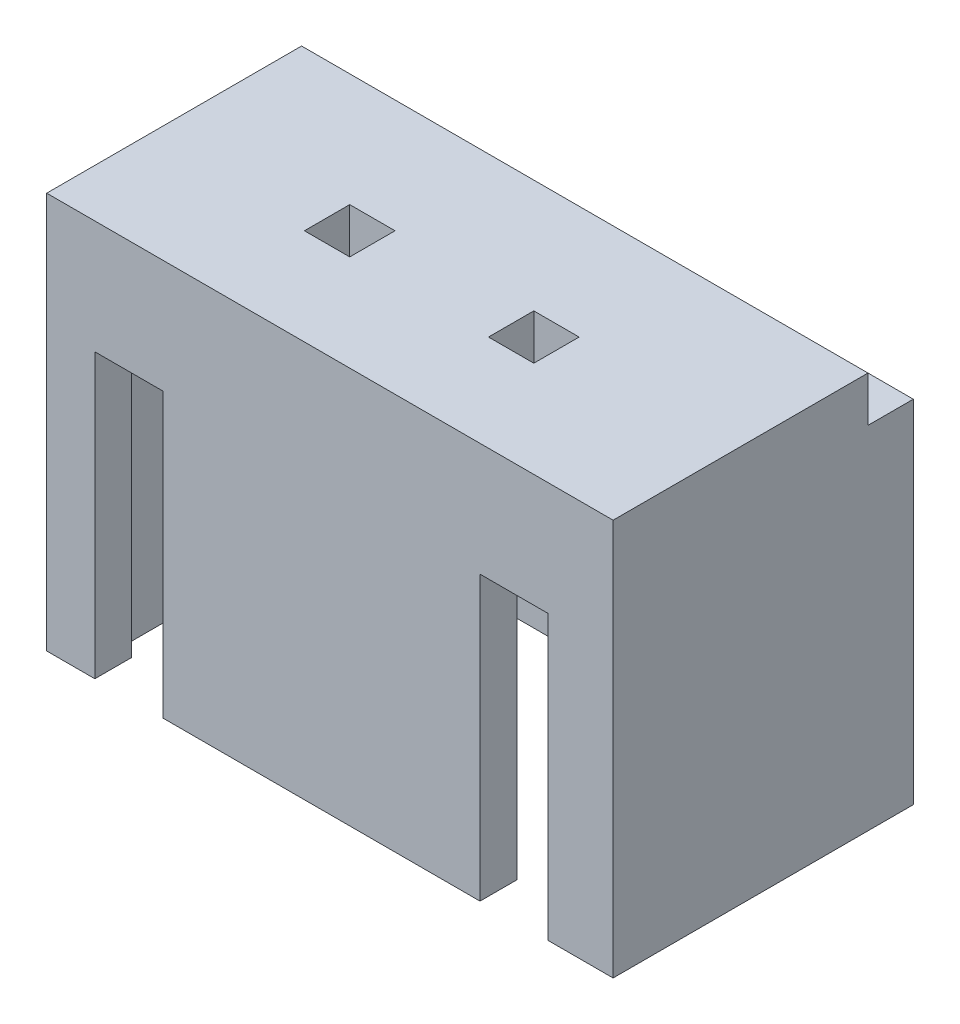
ISO-10303-21;
HEADER;
FILE_DESCRIPTION(('STEP AP214'),'2;1');
FILE_NAME('part.step','',(''),(''),'','','');
FILE_SCHEMA(('AUTOMOTIVE_DESIGN { 1 0 10303 214 1 1 1 1 }'));
ENDSEC;
DATA;
#1=APPLICATION_CONTEXT('core data for automotive mechanical design processes');
#2=APPLICATION_PROTOCOL_DEFINITION('international standard','automotive_design',2000,#1);
#3=PRODUCT_CONTEXT('',#1,'mechanical');
#4=PRODUCT('Part','Part','',(#3));
#5=PRODUCT_RELATED_PRODUCT_CATEGORY('part','',(#4));
#6=PRODUCT_DEFINITION_FORMATION('','',#4);
#7=PRODUCT_DEFINITION_CONTEXT('part definition',#1,'design');
#8=PRODUCT_DEFINITION('design','',#6,#7);
#9=PRODUCT_DEFINITION_SHAPE('','',#8);
#10=(LENGTH_UNIT() NAMED_UNIT(*) SI_UNIT(.MILLI.,.METRE.));
#11=(NAMED_UNIT(*) PLANE_ANGLE_UNIT() SI_UNIT($,.RADIAN.));
#12=(NAMED_UNIT(*) SI_UNIT($,.STERADIAN.) SOLID_ANGLE_UNIT());
#13=UNCERTAINTY_MEASURE_WITH_UNIT(LENGTH_MEASURE(1.E-05),#10,'distance_accuracy_value','');
#14=(GEOMETRIC_REPRESENTATION_CONTEXT(3) GLOBAL_UNCERTAINTY_ASSIGNED_CONTEXT((#13)) GLOBAL_UNIT_ASSIGNED_CONTEXT((#10,
#11,#12)) REPRESENTATION_CONTEXT('',''));
#15=CARTESIAN_POINT('',(0.,0.,0.));
#16=DIRECTION('',(0.,0.,1.));
#17=DIRECTION('',(1.,0.,0.));
#18=AXIS2_PLACEMENT_3D('',#15,#16,#17);
#19=CARTESIAN_POINT('',(5.,7.,2.65));
#20=DIRECTION('',(-1.,0.,0.));
#21=DIRECTION('',(0.,0.,1.));
#22=AXIS2_PLACEMENT_3D('',#19,#20,#21);
#23=PLANE('',#22);
#24=DIRECTION('',(0.,1.,0.));
#25=VECTOR('',#24,1.);
#26=CARTESIAN_POINT('',(5.,6.2,-1.85));
#27=LINE('',#26,#25);
#28=CARTESIAN_POINT('',(5.,6.2,-1.85));
#29=VERTEX_POINT('',#28);
#30=CARTESIAN_POINT('',(5.,7.,-1.85));
#31=VERTEX_POINT('',#30);
#32=EDGE_CURVE('E304',#29,#31,#27,.T.);
#33=ORIENTED_EDGE('',*,*,#32,.T.);
#34=DIRECTION('',(0.,0.,-1.));
#35=VECTOR('',#34,1.);
#36=CARTESIAN_POINT('',(5.,7.,2.65));
#37=LINE('',#36,#35);
#38=CARTESIAN_POINT('',(5.,7.,2.65));
#39=VERTEX_POINT('',#38);
#40=EDGE_CURVE('E380',#39,#31,#37,.T.);
#41=ORIENTED_EDGE('',*,*,#40,.F.);
#42=DIRECTION('',(0.,-1.,0.));
#43=VECTOR('',#42,1.);
#44=CARTESIAN_POINT('',(5.,7.,2.65));
#45=LINE('',#44,#43);
#46=CARTESIAN_POINT('',(5.,0.,2.65));
#47=VERTEX_POINT('',#46);
#48=EDGE_CURVE('E388',#39,#47,#45,.T.);
#49=ORIENTED_EDGE('',*,*,#48,.T.);
#50=DIRECTION('',(0.,0.,-1.));
#51=VECTOR('',#50,1.);
#52=CARTESIAN_POINT('',(5.,0.,2.65));
#53=LINE('',#52,#51);
#54=CARTESIAN_POINT('',(5.,0.,-2.65));
#55=VERTEX_POINT('',#54);
#56=EDGE_CURVE('E375',#47,#55,#53,.T.);
#57=ORIENTED_EDGE('',*,*,#56,.T.);
#58=DIRECTION('',(0.,-1.,0.));
#59=VECTOR('',#58,1.);
#60=CARTESIAN_POINT('',(5.,7.,-2.65));
#61=LINE('',#60,#59);
#62=CARTESIAN_POINT('',(5.,6.2,-2.65));
#63=VERTEX_POINT('',#62);
#64=EDGE_CURVE('E407',#63,#55,#61,.T.);
#65=ORIENTED_EDGE('',*,*,#64,.F.);
#66=DIRECTION('',(0.,0.,-1.));
#67=VECTOR('',#66,1.);
#68=CARTESIAN_POINT('',(5.,6.2,-1.85));
#69=LINE('',#68,#67);
#70=EDGE_CURVE('E292',#29,#63,#69,.T.);
#71=ORIENTED_EDGE('',*,*,#70,.F.);
#72=EDGE_LOOP('',(#33,#41,#49,#57,#65,#71));
#73=FACE_BOUND('',#72,.T.);
#74=ADVANCED_FACE('F33',(#73),#23,.F.);
#75=CARTESIAN_POINT('',(-5.,7.,-2.65));
#76=DIRECTION('',(0.,0.,1.));
#77=DIRECTION('',(1.,0.,0.));
#78=AXIS2_PLACEMENT_3D('',#75,#76,#77);
#79=PLANE('',#78);
#80=DIRECTION('',(-1.,0.,0.));
#81=VECTOR('',#80,1.);
#82=CARTESIAN_POINT('',(5.,6.2,-2.65));
#83=LINE('',#82,#81);
#84=CARTESIAN_POINT('',(-5.,6.2,-2.65));
#85=VERTEX_POINT('',#84);
#86=EDGE_CURVE('E294',#63,#85,#83,.T.);
#87=ORIENTED_EDGE('',*,*,#86,.F.);
#88=ORIENTED_EDGE('',*,*,#64,.T.);
#89=DIRECTION('',(-1.,0.,0.));
#90=VECTOR('',#89,1.);
#91=CARTESIAN_POINT('',(-5.,0.,-2.65));
#92=LINE('',#91,#90);
#93=CARTESIAN_POINT('',(-5.,0.,-2.65));
#94=VERTEX_POINT('',#93);
#95=EDGE_CURVE('E391',#55,#94,#92,.T.);
#96=ORIENTED_EDGE('',*,*,#95,.T.);
#97=DIRECTION('',(0.,-1.,0.));
#98=VECTOR('',#97,1.);
#99=CARTESIAN_POINT('',(-5.,7.,-2.65));
#100=LINE('',#99,#98);
#101=EDGE_CURVE('E405',#85,#94,#100,.T.);
#102=ORIENTED_EDGE('',*,*,#101,.F.);
#103=EDGE_LOOP('',(#87,#88,#96,#102));
#104=FACE_BOUND('',#103,.T.);
#105=ADVANCED_FACE('F458',(#104),#79,.F.);
#106=CARTESIAN_POINT('',(-5.,7.,2.65));
#107=DIRECTION('',(1.,0.,0.));
#108=DIRECTION('',(0.,0.,-1.));
#109=AXIS2_PLACEMENT_3D('',#106,#107,#108);
#110=PLANE('',#109);
#111=DIRECTION('',(0.,1.,0.));
#112=VECTOR('',#111,1.);
#113=CARTESIAN_POINT('',(-5.,6.2,-1.85));
#114=LINE('',#113,#112);
#115=CARTESIAN_POINT('',(-5.,6.2,-1.85));
#116=VERTEX_POINT('',#115);
#117=CARTESIAN_POINT('',(-5.,7.,-1.85));
#118=VERTEX_POINT('',#117);
#119=EDGE_CURVE('E301',#116,#118,#114,.T.);
#120=ORIENTED_EDGE('',*,*,#119,.F.);
#121=DIRECTION('',(0.,0.,-1.));
#122=VECTOR('',#121,1.);
#123=CARTESIAN_POINT('',(-5.,6.2,-1.85));
#124=LINE('',#123,#122);
#125=EDGE_CURVE('E296',#116,#85,#124,.T.);
#126=ORIENTED_EDGE('',*,*,#125,.T.);
#127=ORIENTED_EDGE('',*,*,#101,.T.);
#128=DIRECTION('',(0.,0.,1.));
#129=VECTOR('',#128,1.);
#130=CARTESIAN_POINT('',(-5.,0.,2.65));
#131=LINE('',#130,#129);
#132=CARTESIAN_POINT('',(-5.,0.,2.65));
#133=VERTEX_POINT('',#132);
#134=EDGE_CURVE('E394',#94,#133,#131,.T.);
#135=ORIENTED_EDGE('',*,*,#134,.T.);
#136=DIRECTION('',(0.,-1.,0.));
#137=VECTOR('',#136,1.);
#138=CARTESIAN_POINT('',(-5.,7.,2.65));
#139=LINE('',#138,#137);
#140=CARTESIAN_POINT('',(-5.,7.,2.65));
#141=VERTEX_POINT('',#140);
#142=EDGE_CURVE('E402',#141,#133,#139,.T.);
#143=ORIENTED_EDGE('',*,*,#142,.F.);
#144=DIRECTION('',(0.,0.,1.));
#145=VECTOR('',#144,1.);
#146=CARTESIAN_POINT('',(-5.,7.,2.65));
#147=LINE('',#146,#145);
#148=EDGE_CURVE('E383',#118,#141,#147,.T.);
#149=ORIENTED_EDGE('',*,*,#148,.F.);
#150=EDGE_LOOP('',(#120,#126,#127,#135,#143,#149));
#151=FACE_BOUND('',#150,.T.);
#152=ADVANCED_FACE('F463',(#151),#110,.F.);
#153=CARTESIAN_POINT('',(0.,7.,0.));
#154=DIRECTION('',(0.,-1.,0.));
#155=DIRECTION('',(0.,0.,-1.));
#156=AXIS2_PLACEMENT_3D('',#153,#154,#155);
#157=PLANE('',#156);
#158=DIRECTION('',(-1.,0.,0.));
#159=VECTOR('',#158,1.);
#160=CARTESIAN_POINT('',(-1.34999999999998,7.,0.14999999999973));
#161=LINE('',#160,#159);
#162=CARTESIAN_POINT('',(-1.34999999999998,7.,0.14999999999973));
#163=VERTEX_POINT('',#162);
#164=CARTESIAN_POINT('',(-2.14999999999998,7.,0.14999999999973));
#165=VERTEX_POINT('',#164);
#166=EDGE_CURVE('E256',#163,#165,#161,.T.);
#167=ORIENTED_EDGE('',*,*,#166,.F.);
#168=DIRECTION('',(0.,0.,-1.));
#169=VECTOR('',#168,1.);
#170=CARTESIAN_POINT('',(-1.34999999999998,7.,0.949999999999733));
#171=LINE('',#170,#169);
#172=CARTESIAN_POINT('',(-1.34999999999998,7.,0.949999999999733));
#173=VERTEX_POINT('',#172);
#174=EDGE_CURVE('E47',#173,#163,#171,.T.);
#175=ORIENTED_EDGE('',*,*,#174,.F.);
#176=DIRECTION('',(1.,0.,0.));
#177=VECTOR('',#176,1.);
#178=CARTESIAN_POINT('',(-1.34999999999998,7.,0.949999999999733));
#179=LINE('',#178,#177);
#180=CARTESIAN_POINT('',(-2.14999999999998,7.,0.949999999999733));
#181=VERTEX_POINT('',#180);
#182=EDGE_CURVE('E261',#181,#173,#179,.T.);
#183=ORIENTED_EDGE('',*,*,#182,.F.);
#184=DIRECTION('',(0.,0.,1.));
#185=VECTOR('',#184,1.);
#186=CARTESIAN_POINT('',(-2.14999999999998,7.,0.949999999999733));
#187=LINE('',#186,#185);
#188=EDGE_CURVE('E258',#165,#181,#187,.T.);
#189=ORIENTED_EDGE('',*,*,#188,.F.);
#190=EDGE_LOOP('',(#167,#175,#183,#189));
#191=FACE_BOUND('',#190,.T.);
#192=DIRECTION('',(-1.,0.,0.));
#193=VECTOR('',#192,1.);
#194=CARTESIAN_POINT('',(1.90000000000002,7.,0.149999999999744));
#195=LINE('',#194,#193);
#196=CARTESIAN_POINT('',(1.90000000000002,7.,0.149999999999744));
#197=VERTEX_POINT('',#196);
#198=CARTESIAN_POINT('',(1.10000000000002,7.,0.149999999999744));
#199=VERTEX_POINT('',#198);
#200=EDGE_CURVE('E273',#197,#199,#195,.T.);
#201=ORIENTED_EDGE('',*,*,#200,.F.);
#202=DIRECTION('',(0.,0.,-1.));
#203=VECTOR('',#202,1.);
#204=CARTESIAN_POINT('',(1.90000000000002,7.,0.149999999999744));
#205=LINE('',#204,#203);
#206=CARTESIAN_POINT('',(1.90000000000002,7.,0.949999999999742));
#207=VERTEX_POINT('',#206);
#208=EDGE_CURVE('E267',#207,#197,#205,.T.);
#209=ORIENTED_EDGE('',*,*,#208,.F.);
#210=DIRECTION('',(1.,0.,0.));
#211=VECTOR('',#210,1.);
#212=CARTESIAN_POINT('',(1.90000000000002,7.,0.949999999999742));
#213=LINE('',#212,#211);
#214=CARTESIAN_POINT('',(1.10000000000002,7.,0.949999999999742));
#215=VERTEX_POINT('',#214);
#216=EDGE_CURVE('E279',#215,#207,#213,.T.);
#217=ORIENTED_EDGE('',*,*,#216,.F.);
#218=DIRECTION('',(0.,0.,1.));
#219=VECTOR('',#218,1.);
#220=CARTESIAN_POINT('',(1.10000000000002,7.,0.149999999999744));
#221=LINE('',#220,#219);
#222=EDGE_CURVE('E276',#199,#215,#221,.T.);
#223=ORIENTED_EDGE('',*,*,#222,.F.);
#224=EDGE_LOOP('',(#201,#209,#217,#223));
#225=FACE_BOUND('',#224,.T.);
#226=DIRECTION('',(-1.,0.,0.));
#227=VECTOR('',#226,1.);
#228=CARTESIAN_POINT('',(5.,7.,-1.85));
#229=LINE('',#228,#227);
#230=EDGE_CURVE('E285',#31,#118,#229,.T.);
#231=ORIENTED_EDGE('',*,*,#230,.T.);
#232=ORIENTED_EDGE('',*,*,#148,.T.);
#233=DIRECTION('',(1.,0.,0.));
#234=VECTOR('',#233,1.);
#235=CARTESIAN_POINT('',(-5.,7.,2.65));
#236=LINE('',#235,#234);
#237=EDGE_CURVE('E386',#141,#39,#236,.T.);
#238=ORIENTED_EDGE('',*,*,#237,.T.);
#239=ORIENTED_EDGE('',*,*,#40,.T.);
#240=EDGE_LOOP('',(#231,#232,#238,#239));
#241=FACE_BOUND('',#240,.T.);
#242=ADVANCED_FACE('F440',(#191,#225,#241),#157,.F.);
#243=CARTESIAN_POINT('',(0.,0.,0.));
#244=DIRECTION('',(0.,-1.,0.));
#245=DIRECTION('',(0.,0.,-1.));
#246=AXIS2_PLACEMENT_3D('',#243,#244,#245);
#247=PLANE('',#246);
#248=DIRECTION('',(0.,0.,1.));
#249=VECTOR('',#248,1.);
#250=CARTESIAN_POINT('',(2.65,0.,-1.35));
#251=LINE('',#250,#249);
#252=CARTESIAN_POINT('',(2.65,0.,2.));
#253=VERTEX_POINT('',#252);
#254=CARTESIAN_POINT('',(2.65,0.,2.65));
#255=VERTEX_POINT('',#254);
#256=EDGE_CURVE('E316',#253,#255,#251,.T.);
#257=ORIENTED_EDGE('',*,*,#256,.T.);
#258=DIRECTION('',(1.,0.,0.));
#259=VECTOR('',#258,1.);
#260=CARTESIAN_POINT('',(-5.,0.,2.65));
#261=LINE('',#260,#259);
#262=CARTESIAN_POINT('',(-2.95,0.,2.65));
#263=VERTEX_POINT('',#262);
#264=EDGE_CURVE('E399',#263,#255,#261,.T.);
#265=ORIENTED_EDGE('',*,*,#264,.F.);
#266=DIRECTION('',(0.,0.,1.));
#267=VECTOR('',#266,1.);
#268=CARTESIAN_POINT('',(-2.95,0.,-1.35));
#269=LINE('',#268,#267);
#270=CARTESIAN_POINT('',(-2.95,0.,2.));
#271=VERTEX_POINT('',#270);
#272=EDGE_CURVE('E345',#271,#263,#269,.T.);
#273=ORIENTED_EDGE('',*,*,#272,.F.);
#274=DIRECTION('',(-1.,0.,0.));
#275=VECTOR('',#274,1.);
#276=CARTESIAN_POINT('',(-4.4,0.,2.));
#277=LINE('',#276,#275);
#278=EDGE_CURVE('E372',#253,#271,#277,.T.);
#279=ORIENTED_EDGE('',*,*,#278,.F.);
#280=EDGE_LOOP('',(#257,#265,#273,#279));
#281=FACE_BOUND('',#280,.T.);
#282=ADVANCED_FACE('F538',(#281),#247,.T.);
#283=CARTESIAN_POINT('',(-4.4,5.,2.));
#284=DIRECTION('',(0.,0.,1.));
#285=DIRECTION('',(1.,0.,0.));
#286=AXIS2_PLACEMENT_3D('',#283,#284,#285);
#287=PLANE('',#286);
#288=DIRECTION('',(-1.,0.,0.));
#289=VECTOR('',#288,1.);
#290=CARTESIAN_POINT('',(-4.4,5.,2.));
#291=LINE('',#290,#289);
#292=CARTESIAN_POINT('',(2.65,5.,2.));
#293=VERTEX_POINT('',#292);
#294=CARTESIAN_POINT('',(-2.95,5.,2.));
#295=VERTEX_POINT('',#294);
#296=EDGE_CURVE('E363',#293,#295,#291,.T.);
#297=ORIENTED_EDGE('',*,*,#296,.F.);
#298=DIRECTION('',(0.,-1.,0.));
#299=VECTOR('',#298,1.);
#300=CARTESIAN_POINT('',(2.65,5.,2.));
#301=LINE('',#300,#299);
#302=EDGE_CURVE('E328',#293,#253,#301,.T.);
#303=ORIENTED_EDGE('',*,*,#302,.T.);
#304=ORIENTED_EDGE('',*,*,#278,.T.);
#305=DIRECTION('',(0.,1.,0.));
#306=VECTOR('',#305,1.);
#307=CARTESIAN_POINT('',(-2.95,5.,2.));
#308=LINE('',#307,#306);
#309=EDGE_CURVE('E342',#271,#295,#308,.T.);
#310=ORIENTED_EDGE('',*,*,#309,.T.);
#311=EDGE_LOOP('',(#297,#303,#304,#310));
#312=FACE_BOUND('',#311,.T.);
#313=ADVANCED_FACE('F531',(#312),#287,.F.);
#314=CARTESIAN_POINT('',(-4.15,5.,2.));
#315=VERTEX_POINT('',#314);
#316=CARTESIAN_POINT('',(-4.4,5.,2.));
#317=VERTEX_POINT('',#316);
#318=EDGE_CURVE('E357',#315,#317,#291,.T.);
#319=ORIENTED_EDGE('',*,*,#318,.F.);
#320=DIRECTION('',(0.,-1.,0.));
#321=VECTOR('',#320,1.);
#322=CARTESIAN_POINT('',(-4.15,5.,2.));
#323=LINE('',#322,#321);
#324=CARTESIAN_POINT('',(-4.15,0.,2.));
#325=VERTEX_POINT('',#324);
#326=EDGE_CURVE('E351',#315,#325,#323,.T.);
#327=ORIENTED_EDGE('',*,*,#326,.T.);
#328=CARTESIAN_POINT('',(-4.4,0.,2.));
#329=VERTEX_POINT('',#328);
#330=EDGE_CURVE('E368',#325,#329,#277,.T.);
#331=ORIENTED_EDGE('',*,*,#330,.T.);
#332=DIRECTION('',(0.,-1.,0.));
#333=VECTOR('',#332,1.);
#334=CARTESIAN_POINT('',(-4.4,5.,2.));
#335=LINE('',#334,#333);
#336=EDGE_CURVE('E231',#317,#329,#335,.T.);
#337=ORIENTED_EDGE('',*,*,#336,.F.);
#338=EDGE_LOOP('',(#319,#327,#331,#337));
#339=FACE_BOUND('',#338,.T.);
#340=ADVANCED_FACE('F532',(#339),#287,.F.);
#341=CARTESIAN_POINT('',(-5.,7.,2.65));
#342=DIRECTION('',(0.,0.,-1.));
#343=DIRECTION('',(-1.,0.,0.));
#344=AXIS2_PLACEMENT_3D('',#341,#342,#343);
#345=PLANE('',#344);
#346=ORIENTED_EDGE('',*,*,#264,.T.);
#347=DIRECTION('',(0.,-1.,0.));
#348=VECTOR('',#347,1.);
#349=CARTESIAN_POINT('',(2.65,0.,2.65));
#350=LINE('',#349,#348);
#351=CARTESIAN_POINT('',(2.65,5.,2.65));
#352=VERTEX_POINT('',#351);
#353=EDGE_CURVE('E307',#352,#255,#350,.T.);
#354=ORIENTED_EDGE('',*,*,#353,.F.);
#355=DIRECTION('',(-1.,0.,0.));
#356=VECTOR('',#355,1.);
#357=CARTESIAN_POINT('',(2.65,5.,2.65));
#358=LINE('',#357,#356);
#359=CARTESIAN_POINT('',(3.85,5.,2.65));
#360=VERTEX_POINT('',#359);
#361=EDGE_CURVE('E313',#360,#352,#358,.T.);
#362=ORIENTED_EDGE('',*,*,#361,.F.);
#363=DIRECTION('',(0.,1.,0.));
#364=VECTOR('',#363,1.);
#365=CARTESIAN_POINT('',(3.85,0.,2.65));
#366=LINE('',#365,#364);
#367=CARTESIAN_POINT('',(3.85,0.,2.65));
#368=VERTEX_POINT('',#367);
#369=EDGE_CURVE('E310',#368,#360,#366,.T.);
#370=ORIENTED_EDGE('',*,*,#369,.F.);
#371=EDGE_CURVE('E396',#368,#47,#261,.T.);
#372=ORIENTED_EDGE('',*,*,#371,.T.);
#373=ORIENTED_EDGE('',*,*,#48,.F.);
#374=ORIENTED_EDGE('',*,*,#237,.F.);
#375=ORIENTED_EDGE('',*,*,#142,.T.);
#376=CARTESIAN_POINT('',(-4.15,0.,2.65));
#377=VERTEX_POINT('',#376);
#378=EDGE_CURVE('E384',#133,#377,#261,.T.);
#379=ORIENTED_EDGE('',*,*,#378,.T.);
#380=DIRECTION('',(0.,-1.,0.));
#381=VECTOR('',#380,1.);
#382=CARTESIAN_POINT('',(-4.15,0.,2.65));
#383=LINE('',#382,#381);
#384=CARTESIAN_POINT('',(-4.15,5.,2.65));
#385=VERTEX_POINT('',#384);
#386=EDGE_CURVE('E331',#385,#377,#383,.T.);
#387=ORIENTED_EDGE('',*,*,#386,.F.);
#388=DIRECTION('',(-1.,0.,0.));
#389=VECTOR('',#388,1.);
#390=CARTESIAN_POINT('',(-4.15,5.,2.65));
#391=LINE('',#390,#389);
#392=CARTESIAN_POINT('',(-2.95,5.,2.65));
#393=VERTEX_POINT('',#392);
#394=EDGE_CURVE('E336',#393,#385,#391,.T.);
#395=ORIENTED_EDGE('',*,*,#394,.F.);
#396=DIRECTION('',(0.,1.,0.));
#397=VECTOR('',#396,1.);
#398=CARTESIAN_POINT('',(-2.95,0.,2.65));
#399=LINE('',#398,#397);
#400=EDGE_CURVE('E333',#263,#393,#399,.T.);
#401=ORIENTED_EDGE('',*,*,#400,.F.);
#402=EDGE_LOOP('',(#346,#354,#362,#370,#372,#373,#374,#375,#379,#387,#395,#401));
#403=FACE_BOUND('',#402,.T.);
#404=ADVANCED_FACE('F477',(#403),#345,.F.);
#405=DIRECTION('',(0.,0.,1.));
#406=VECTOR('',#405,1.);
#407=CARTESIAN_POINT('',(3.85,0.,-1.35));
#408=LINE('',#407,#406);
#409=CARTESIAN_POINT('',(3.85,0.,2.));
#410=VERTEX_POINT('',#409);
#411=EDGE_CURVE('E322',#410,#368,#408,.T.);
#412=ORIENTED_EDGE('',*,*,#411,.F.);
#413=CARTESIAN_POINT('',(4.4,0.,2.));
#414=VERTEX_POINT('',#413);
#415=EDGE_CURVE('E369',#414,#410,#277,.T.);
#416=ORIENTED_EDGE('',*,*,#415,.F.);
#417=DIRECTION('',(0.,0.,1.));
#418=VECTOR('',#417,1.);
#419=CARTESIAN_POINT('',(4.4,0.,-2.));
#420=LINE('',#419,#418);
#421=CARTESIAN_POINT('',(4.4,0.,-2.));
#422=VERTEX_POINT('',#421);
#423=EDGE_CURVE('E354',#422,#414,#420,.T.);
#424=ORIENTED_EDGE('',*,*,#423,.F.);
#425=DIRECTION('',(1.,0.,0.));
#426=VECTOR('',#425,1.);
#427=CARTESIAN_POINT('',(-4.4,0.,-2.));
#428=LINE('',#427,#426);
#429=CARTESIAN_POINT('',(-4.4,0.,-2.));
#430=VERTEX_POINT('',#429);
#431=EDGE_CURVE('E358',#430,#422,#428,.T.);
#432=ORIENTED_EDGE('',*,*,#431,.F.);
#433=DIRECTION('',(0.,0.,-1.));
#434=VECTOR('',#433,1.);
#435=CARTESIAN_POINT('',(-4.4,0.,-2.));
#436=LINE('',#435,#434);
#437=EDGE_CURVE('E226',#329,#430,#436,.T.);
#438=ORIENTED_EDGE('',*,*,#437,.F.);
#439=ORIENTED_EDGE('',*,*,#330,.F.);
#440=DIRECTION('',(0.,0.,1.));
#441=VECTOR('',#440,1.);
#442=CARTESIAN_POINT('',(-4.15,0.,-1.35));
#443=LINE('',#442,#441);
#444=EDGE_CURVE('E339',#325,#377,#443,.T.);
#445=ORIENTED_EDGE('',*,*,#444,.T.);
#446=ORIENTED_EDGE('',*,*,#378,.F.);
#447=ORIENTED_EDGE('',*,*,#134,.F.);
#448=ORIENTED_EDGE('',*,*,#95,.F.);
#449=ORIENTED_EDGE('',*,*,#56,.F.);
#450=ORIENTED_EDGE('',*,*,#371,.F.);
#451=EDGE_LOOP('',(#412,#416,#424,#432,#438,#439,#445,#446,#447,#448,#449,#450));
#452=FACE_BOUND('',#451,.T.);
#453=ADVANCED_FACE('F484',(#452),#247,.T.);
#454=CARTESIAN_POINT('',(4.4,5.,-2.));
#455=DIRECTION('',(1.,0.,0.));
#456=DIRECTION('',(0.,0.,-1.));
#457=AXIS2_PLACEMENT_3D('',#454,#455,#456);
#458=PLANE('',#457);
#459=ORIENTED_EDGE('',*,*,#423,.T.);
#460=DIRECTION('',(0.,-1.,0.));
#461=VECTOR('',#460,1.);
#462=CARTESIAN_POINT('',(4.4,5.,2.));
#463=LINE('',#462,#461);
#464=CARTESIAN_POINT('',(4.4,5.,2.));
#465=VERTEX_POINT('',#464);
#466=EDGE_CURVE('E366',#465,#414,#463,.T.);
#467=ORIENTED_EDGE('',*,*,#466,.F.);
#468=DIRECTION('',(0.,0.,1.));
#469=VECTOR('',#468,1.);
#470=CARTESIAN_POINT('',(4.4,5.,-2.));
#471=LINE('',#470,#469);
#472=CARTESIAN_POINT('',(4.4,5.,-1.));
#473=VERTEX_POINT('',#472);
#474=EDGE_CURVE('E355',#473,#465,#471,.T.);
#475=ORIENTED_EDGE('',*,*,#474,.F.);
#476=DIRECTION('',(0.,-1.,0.));
#477=VECTOR('',#476,1.);
#478=CARTESIAN_POINT('',(4.4,5.3,-1.));
#479=LINE('',#478,#477);
#480=CARTESIAN_POINT('',(4.4,5.3,-1.));
#481=VERTEX_POINT('',#480);
#482=EDGE_CURVE('E250',#481,#473,#479,.T.);
#483=ORIENTED_EDGE('',*,*,#482,.F.);
#484=DIRECTION('',(0.,0.,1.));
#485=VECTOR('',#484,1.);
#486=CARTESIAN_POINT('',(4.4,5.3,-2.));
#487=LINE('',#486,#485);
#488=CARTESIAN_POINT('',(4.4,5.3,-2.));
#489=VERTEX_POINT('',#488);
#490=EDGE_CURVE('E239',#489,#481,#487,.T.);
#491=ORIENTED_EDGE('',*,*,#490,.F.);
#492=DIRECTION('',(0.,-1.,0.));
#493=VECTOR('',#492,1.);
#494=CARTESIAN_POINT('',(4.4,5.,-2.));
#495=LINE('',#494,#493);
#496=EDGE_CURVE('E230',#489,#422,#495,.T.);
#497=ORIENTED_EDGE('',*,*,#496,.T.);
#498=EDGE_LOOP('',(#459,#467,#475,#483,#491,#497));
#499=FACE_BOUND('',#498,.T.);
#500=ADVANCED_FACE('F525',(#499),#458,.F.);
#501=CARTESIAN_POINT('',(-4.4,5.,-2.));
#502=DIRECTION('',(0.,0.,-1.));
#503=DIRECTION('',(-1.,0.,0.));
#504=AXIS2_PLACEMENT_3D('',#501,#502,#503);
#505=PLANE('',#504);
#506=ORIENTED_EDGE('',*,*,#431,.T.);
#507=ORIENTED_EDGE('',*,*,#496,.F.);
#508=DIRECTION('',(1.,0.,0.));
#509=VECTOR('',#508,1.);
#510=CARTESIAN_POINT('',(-4.4,5.3,-2.));
#511=LINE('',#510,#509);
#512=CARTESIAN_POINT('',(-4.4,5.3,-2.));
#513=VERTEX_POINT('',#512);
#514=EDGE_CURVE('E234',#513,#489,#511,.T.);
#515=ORIENTED_EDGE('',*,*,#514,.F.);
#516=DIRECTION('',(0.,-1.,0.));
#517=VECTOR('',#516,1.);
#518=CARTESIAN_POINT('',(-4.4,5.,-2.));
#519=LINE('',#518,#517);
#520=EDGE_CURVE('E218',#513,#430,#519,.T.);
#521=ORIENTED_EDGE('',*,*,#520,.T.);
#522=EDGE_LOOP('',(#506,#507,#515,#521));
#523=FACE_BOUND('',#522,.T.);
#524=ADVANCED_FACE('F235',(#523),#505,.F.);
#525=CARTESIAN_POINT('',(-4.4,5.,-2.));
#526=DIRECTION('',(-1.,0.,0.));
#527=DIRECTION('',(0.,0.,1.));
#528=AXIS2_PLACEMENT_3D('',#525,#526,#527);
#529=PLANE('',#528);
#530=ORIENTED_EDGE('',*,*,#437,.T.);
#531=ORIENTED_EDGE('',*,*,#520,.F.);
#532=DIRECTION('',(0.,0.,-1.));
#533=VECTOR('',#532,1.);
#534=CARTESIAN_POINT('',(-4.4,5.3,-2.));
#535=LINE('',#534,#533);
#536=CARTESIAN_POINT('',(-4.4,5.3,-1.));
#537=VERTEX_POINT('',#536);
#538=EDGE_CURVE('E222',#537,#513,#535,.T.);
#539=ORIENTED_EDGE('',*,*,#538,.F.);
#540=DIRECTION('',(0.,-1.,0.));
#541=VECTOR('',#540,1.);
#542=CARTESIAN_POINT('',(-4.4,5.3,-1.));
#543=LINE('',#542,#541);
#544=CARTESIAN_POINT('',(-4.4,5.,-1.));
#545=VERTEX_POINT('',#544);
#546=EDGE_CURVE('E252',#537,#545,#543,.T.);
#547=ORIENTED_EDGE('',*,*,#546,.T.);
#548=DIRECTION('',(0.,0.,-1.));
#549=VECTOR('',#548,1.);
#550=CARTESIAN_POINT('',(-4.4,5.,-2.));
#551=LINE('',#550,#549);
#552=EDGE_CURVE('E362',#317,#545,#551,.T.);
#553=ORIENTED_EDGE('',*,*,#552,.F.);
#554=ORIENTED_EDGE('',*,*,#336,.T.);
#555=EDGE_LOOP('',(#530,#531,#539,#547,#553,#554));
#556=FACE_BOUND('',#555,.T.);
#557=ADVANCED_FACE('F220',(#556),#529,.F.);
#558=ORIENTED_EDGE('',*,*,#415,.T.);
#559=DIRECTION('',(0.,1.,0.));
#560=VECTOR('',#559,1.);
#561=CARTESIAN_POINT('',(3.85,5.,2.));
#562=LINE('',#561,#560);
#563=CARTESIAN_POINT('',(3.85,5.,2.));
#564=VERTEX_POINT('',#563);
#565=EDGE_CURVE('E319',#410,#564,#562,.T.);
#566=ORIENTED_EDGE('',*,*,#565,.T.);
#567=EDGE_CURVE('E359',#465,#564,#291,.T.);
#568=ORIENTED_EDGE('',*,*,#567,.F.);
#569=ORIENTED_EDGE('',*,*,#466,.T.);
#570=EDGE_LOOP('',(#558,#566,#568,#569));
#571=FACE_BOUND('',#570,.T.);
#572=ADVANCED_FACE('F522',(#571),#287,.F.);
#573=CARTESIAN_POINT('',(0.,5.,0.));
#574=DIRECTION('',(0.,1.,0.));
#575=DIRECTION('',(0.,0.,1.));
#576=AXIS2_PLACEMENT_3D('',#573,#574,#575);
#577=PLANE('',#576);
#578=DIRECTION('',(1.,0.,0.));
#579=VECTOR('',#578,1.);
#580=CARTESIAN_POINT('',(0.,5.,0.949999999999733));
#581=LINE('',#580,#579);
#582=CARTESIAN_POINT('',(-2.14999999999998,5.,0.949999999999733));
#583=VERTEX_POINT('',#582);
#584=CARTESIAN_POINT('',(-1.34999999999998,5.,0.949999999999733));
#585=VERTEX_POINT('',#584);
#586=EDGE_CURVE('E40',#583,#585,#581,.T.);
#587=ORIENTED_EDGE('',*,*,#586,.T.);
#588=DIRECTION('',(0.,0.,-1.));
#589=VECTOR('',#588,1.);
#590=CARTESIAN_POINT('',(-1.34999999999998,5.,0.));
#591=LINE('',#590,#589);
#592=CARTESIAN_POINT('',(-1.34999999999998,5.,0.14999999999973));
#593=VERTEX_POINT('',#592);
#594=EDGE_CURVE('E11',#585,#593,#591,.T.);
#595=ORIENTED_EDGE('',*,*,#594,.T.);
#596=DIRECTION('',(-1.,0.,0.));
#597=VECTOR('',#596,1.);
#598=CARTESIAN_POINT('',(0.,5.,0.14999999999973));
#599=LINE('',#598,#597);
#600=CARTESIAN_POINT('',(-2.14999999999998,5.,0.14999999999973));
#601=VERTEX_POINT('',#600);
#602=EDGE_CURVE('E421',#593,#601,#599,.T.);
#603=ORIENTED_EDGE('',*,*,#602,.T.);
#604=DIRECTION('',(0.,0.,1.));
#605=VECTOR('',#604,1.);
#606=CARTESIAN_POINT('',(-2.14999999999998,5.,0.));
#607=LINE('',#606,#605);
#608=EDGE_CURVE('E424',#601,#583,#607,.T.);
#609=ORIENTED_EDGE('',*,*,#608,.T.);
#610=EDGE_LOOP('',(#587,#595,#603,#609));
#611=FACE_BOUND('',#610,.T.);
#612=DIRECTION('',(1.,0.,0.));
#613=VECTOR('',#612,1.);
#614=CARTESIAN_POINT('',(0.,5.,0.949999999999742));
#615=LINE('',#614,#613);
#616=CARTESIAN_POINT('',(1.10000000000002,5.,0.949999999999742));
#617=VERTEX_POINT('',#616);
#618=CARTESIAN_POINT('',(1.90000000000002,5.,0.949999999999742));
#619=VERTEX_POINT('',#618);
#620=EDGE_CURVE('E415',#617,#619,#615,.T.);
#621=ORIENTED_EDGE('',*,*,#620,.T.);
#622=DIRECTION('',(0.,0.,-1.));
#623=VECTOR('',#622,1.);
#624=CARTESIAN_POINT('',(1.90000000000002,5.,0.));
#625=LINE('',#624,#623);
#626=CARTESIAN_POINT('',(1.90000000000002,5.,0.149999999999744));
#627=VERTEX_POINT('',#626);
#628=EDGE_CURVE('E418',#619,#627,#625,.T.);
#629=ORIENTED_EDGE('',*,*,#628,.T.);
#630=DIRECTION('',(-1.,0.,0.));
#631=VECTOR('',#630,1.);
#632=CARTESIAN_POINT('',(0.,5.,0.149999999999744));
#633=LINE('',#632,#631);
#634=CARTESIAN_POINT('',(1.10000000000002,5.,0.149999999999744));
#635=VERTEX_POINT('',#634);
#636=EDGE_CURVE('E409',#627,#635,#633,.T.);
#637=ORIENTED_EDGE('',*,*,#636,.T.);
#638=DIRECTION('',(0.,0.,1.));
#639=VECTOR('',#638,1.);
#640=CARTESIAN_POINT('',(1.10000000000002,5.,0.));
#641=LINE('',#640,#639);
#642=EDGE_CURVE('E412',#635,#617,#641,.T.);
#643=ORIENTED_EDGE('',*,*,#642,.T.);
#644=EDGE_LOOP('',(#621,#629,#637,#643));
#645=FACE_BOUND('',#644,.T.);
#646=ORIENTED_EDGE('',*,*,#552,.T.);
#647=DIRECTION('',(-1.,0.,0.));
#648=VECTOR('',#647,1.);
#649=CARTESIAN_POINT('',(-4.4,5.,-1.));
#650=LINE('',#649,#648);
#651=EDGE_CURVE('E244',#473,#545,#650,.T.);
#652=ORIENTED_EDGE('',*,*,#651,.F.);
#653=ORIENTED_EDGE('',*,*,#474,.T.);
#654=ORIENTED_EDGE('',*,*,#567,.T.);
#655=DIRECTION('',(0.,0.,1.));
#656=VECTOR('',#655,1.);
#657=CARTESIAN_POINT('',(3.85,5.,-1.35));
#658=LINE('',#657,#656);
#659=EDGE_CURVE('E320',#564,#360,#658,.T.);
#660=ORIENTED_EDGE('',*,*,#659,.T.);
#661=ORIENTED_EDGE('',*,*,#361,.T.);
#662=DIRECTION('',(0.,0.,1.));
#663=VECTOR('',#662,1.);
#664=CARTESIAN_POINT('',(2.65,5.,-1.35));
#665=LINE('',#664,#663);
#666=EDGE_CURVE('E317',#293,#352,#665,.T.);
#667=ORIENTED_EDGE('',*,*,#666,.F.);
#668=ORIENTED_EDGE('',*,*,#296,.T.);
#669=DIRECTION('',(0.,0.,1.));
#670=VECTOR('',#669,1.);
#671=CARTESIAN_POINT('',(-2.95,5.,-1.35));
#672=LINE('',#671,#670);
#673=EDGE_CURVE('E343',#295,#393,#672,.T.);
#674=ORIENTED_EDGE('',*,*,#673,.T.);
#675=ORIENTED_EDGE('',*,*,#394,.T.);
#676=DIRECTION('',(0.,0.,1.));
#677=VECTOR('',#676,1.);
#678=CARTESIAN_POINT('',(-4.15,5.,-1.35));
#679=LINE('',#678,#677);
#680=EDGE_CURVE('E340',#315,#385,#679,.T.);
#681=ORIENTED_EDGE('',*,*,#680,.F.);
#682=ORIENTED_EDGE('',*,*,#318,.T.);
#683=EDGE_LOOP('',(#646,#652,#653,#654,#660,#661,#667,#668,#674,#675,#681,#682));
#684=FACE_BOUND('',#683,.T.);
#685=ADVANCED_FACE('F428',(#611,#645,#684),#577,.F.);
#686=CARTESIAN_POINT('',(-4.15,0.,-1.35));
#687=DIRECTION('',(-1.,0.,0.));
#688=DIRECTION('',(0.,0.,1.));
#689=AXIS2_PLACEMENT_3D('',#686,#687,#688);
#690=PLANE('',#689);
#691=ORIENTED_EDGE('',*,*,#680,.T.);
#692=ORIENTED_EDGE('',*,*,#386,.T.);
#693=ORIENTED_EDGE('',*,*,#444,.F.);
#694=ORIENTED_EDGE('',*,*,#326,.F.);
#695=EDGE_LOOP('',(#691,#692,#693,#694));
#696=FACE_BOUND('',#695,.T.);
#697=ADVANCED_FACE('F515',(#696),#690,.F.);
#698=CARTESIAN_POINT('',(-2.95,0.,-1.35));
#699=DIRECTION('',(1.,0.,0.));
#700=DIRECTION('',(0.,0.,-1.));
#701=AXIS2_PLACEMENT_3D('',#698,#699,#700);
#702=PLANE('',#701);
#703=ORIENTED_EDGE('',*,*,#272,.T.);
#704=ORIENTED_EDGE('',*,*,#400,.T.);
#705=ORIENTED_EDGE('',*,*,#673,.F.);
#706=ORIENTED_EDGE('',*,*,#309,.F.);
#707=EDGE_LOOP('',(#703,#704,#705,#706));
#708=FACE_BOUND('',#707,.T.);
#709=ADVANCED_FACE('F511',(#708),#702,.F.);
#710=CARTESIAN_POINT('',(2.65,0.,-1.35));
#711=DIRECTION('',(-1.,0.,0.));
#712=DIRECTION('',(0.,0.,1.));
#713=AXIS2_PLACEMENT_3D('',#710,#711,#712);
#714=PLANE('',#713);
#715=ORIENTED_EDGE('',*,*,#666,.T.);
#716=ORIENTED_EDGE('',*,*,#353,.T.);
#717=ORIENTED_EDGE('',*,*,#256,.F.);
#718=ORIENTED_EDGE('',*,*,#302,.F.);
#719=EDGE_LOOP('',(#715,#716,#717,#718));
#720=FACE_BOUND('',#719,.T.);
#721=ADVANCED_FACE('F504',(#720),#714,.F.);
#722=CARTESIAN_POINT('',(3.85,0.,-1.35));
#723=DIRECTION('',(1.,0.,0.));
#724=DIRECTION('',(0.,0.,-1.));
#725=AXIS2_PLACEMENT_3D('',#722,#723,#724);
#726=PLANE('',#725);
#727=ORIENTED_EDGE('',*,*,#411,.T.);
#728=ORIENTED_EDGE('',*,*,#369,.T.);
#729=ORIENTED_EDGE('',*,*,#659,.F.);
#730=ORIENTED_EDGE('',*,*,#565,.F.);
#731=EDGE_LOOP('',(#727,#728,#729,#730));
#732=FACE_BOUND('',#731,.T.);
#733=ADVANCED_FACE('F496',(#732),#726,.F.);
#734=CARTESIAN_POINT('',(5.,6.2,-1.85));
#735=DIRECTION('',(0.,0.,-1.));
#736=DIRECTION('',(-1.,0.,0.));
#737=AXIS2_PLACEMENT_3D('',#734,#735,#736);
#738=PLANE('',#737);
#739=ORIENTED_EDGE('',*,*,#230,.F.);
#740=ORIENTED_EDGE('',*,*,#32,.F.);
#741=DIRECTION('',(-1.,0.,0.));
#742=VECTOR('',#741,1.);
#743=CARTESIAN_POINT('',(5.,6.2,-1.85));
#744=LINE('',#743,#742);
#745=EDGE_CURVE('E299',#29,#116,#744,.T.);
#746=ORIENTED_EDGE('',*,*,#745,.T.);
#747=ORIENTED_EDGE('',*,*,#119,.T.);
#748=EDGE_LOOP('',(#739,#740,#746,#747));
#749=FACE_BOUND('',#748,.T.);
#750=ADVANCED_FACE('F494',(#749),#738,.T.);
#751=CARTESIAN_POINT('',(0.,6.2,0.));
#752=DIRECTION('',(0.,1.,0.));
#753=DIRECTION('',(0.,0.,1.));
#754=AXIS2_PLACEMENT_3D('',#751,#752,#753);
#755=PLANE('',#754);
#756=ORIENTED_EDGE('',*,*,#70,.T.);
#757=ORIENTED_EDGE('',*,*,#86,.T.);
#758=ORIENTED_EDGE('',*,*,#125,.F.);
#759=ORIENTED_EDGE('',*,*,#745,.F.);
#760=EDGE_LOOP('',(#756,#757,#758,#759));
#761=FACE_BOUND('',#760,.T.);
#762=ADVANCED_FACE('F491',(#761),#755,.T.);
#763=CARTESIAN_POINT('',(1.90000000000002,-3.,0.149999999999744));
#764=DIRECTION('',(1.,0.,0.));
#765=DIRECTION('',(0.,0.,-1.));
#766=AXIS2_PLACEMENT_3D('',#763,#764,#765);
#767=PLANE('',#766);
#768=DIRECTION('',(0.,1.,0.));
#769=VECTOR('',#768,1.);
#770=CARTESIAN_POINT('',(1.90000000000002,-3.,0.949999999999742));
#771=LINE('',#770,#769);
#772=EDGE_CURVE('E283',#619,#207,#771,.T.);
#773=ORIENTED_EDGE('',*,*,#772,.T.);
#774=ORIENTED_EDGE('',*,*,#208,.T.);
#775=DIRECTION('',(0.,1.,0.));
#776=VECTOR('',#775,1.);
#777=CARTESIAN_POINT('',(1.90000000000002,-3.,0.149999999999744));
#778=LINE('',#777,#776);
#779=EDGE_CURVE('E282',#627,#197,#778,.T.);
#780=ORIENTED_EDGE('',*,*,#779,.F.);
#781=ORIENTED_EDGE('',*,*,#628,.F.);
#782=EDGE_LOOP('',(#773,#774,#780,#781));
#783=FACE_BOUND('',#782,.T.);
#784=ADVANCED_FACE('F502',(#783),#767,.F.);
#785=CARTESIAN_POINT('',(1.90000000000002,-3.,0.949999999999742));
#786=DIRECTION('',(0.,0.,1.));
#787=DIRECTION('',(1.,0.,0.));
#788=AXIS2_PLACEMENT_3D('',#785,#786,#787);
#789=PLANE('',#788);
#790=DIRECTION('',(0.,1.,0.));
#791=VECTOR('',#790,1.);
#792=CARTESIAN_POINT('',(1.10000000000002,-3.,0.949999999999742));
#793=LINE('',#792,#791);
#794=EDGE_CURVE('E286',#617,#215,#793,.T.);
#795=ORIENTED_EDGE('',*,*,#794,.T.);
#796=ORIENTED_EDGE('',*,*,#216,.T.);
#797=ORIENTED_EDGE('',*,*,#772,.F.);
#798=ORIENTED_EDGE('',*,*,#620,.F.);
#799=EDGE_LOOP('',(#795,#796,#797,#798));
#800=FACE_BOUND('',#799,.T.);
#801=ADVANCED_FACE('F647',(#800),#789,.F.);
#802=CARTESIAN_POINT('',(1.10000000000002,-3.,0.149999999999744));
#803=DIRECTION('',(-1.,0.,0.));
#804=DIRECTION('',(0.,0.,1.));
#805=AXIS2_PLACEMENT_3D('',#802,#803,#804);
#806=PLANE('',#805);
#807=DIRECTION('',(0.,1.,0.));
#808=VECTOR('',#807,1.);
#809=CARTESIAN_POINT('',(1.10000000000002,-3.,0.149999999999744));
#810=LINE('',#809,#808);
#811=EDGE_CURVE('E288',#635,#199,#810,.T.);
#812=ORIENTED_EDGE('',*,*,#811,.T.);
#813=ORIENTED_EDGE('',*,*,#222,.T.);
#814=ORIENTED_EDGE('',*,*,#794,.F.);
#815=ORIENTED_EDGE('',*,*,#642,.F.);
#816=EDGE_LOOP('',(#812,#813,#814,#815));
#817=FACE_BOUND('',#816,.T.);
#818=ADVANCED_FACE('F452',(#817),#806,.F.);
#819=CARTESIAN_POINT('',(1.90000000000002,-3.,0.149999999999744));
#820=DIRECTION('',(0.,0.,-1.));
#821=DIRECTION('',(-1.,0.,0.));
#822=AXIS2_PLACEMENT_3D('',#819,#820,#821);
#823=PLANE('',#822);
#824=ORIENTED_EDGE('',*,*,#779,.T.);
#825=ORIENTED_EDGE('',*,*,#200,.T.);
#826=ORIENTED_EDGE('',*,*,#811,.F.);
#827=ORIENTED_EDGE('',*,*,#636,.F.);
#828=EDGE_LOOP('',(#824,#825,#826,#827));
#829=FACE_BOUND('',#828,.T.);
#830=ADVANCED_FACE('F445',(#829),#823,.F.);
#831=CARTESIAN_POINT('',(-1.34999999999998,-3.,0.949999999999733));
#832=DIRECTION('',(1.,0.,0.));
#833=DIRECTION('',(0.,0.,-1.));
#834=AXIS2_PLACEMENT_3D('',#831,#832,#833);
#835=PLANE('',#834);
#836=DIRECTION('',(0.,1.,0.));
#837=VECTOR('',#836,1.);
#838=CARTESIAN_POINT('',(-1.34999999999998,-3.,0.949999999999733));
#839=LINE('',#838,#837);
#840=EDGE_CURVE('E265',#585,#173,#839,.T.);
#841=ORIENTED_EDGE('',*,*,#840,.T.);
#842=ORIENTED_EDGE('',*,*,#174,.T.);
#843=DIRECTION('',(0.,1.,0.));
#844=VECTOR('',#843,1.);
#845=CARTESIAN_POINT('',(-1.34999999999998,-3.,0.14999999999973));
#846=LINE('',#845,#844);
#847=EDGE_CURVE('E264',#593,#163,#846,.T.);
#848=ORIENTED_EDGE('',*,*,#847,.F.);
#849=ORIENTED_EDGE('',*,*,#594,.F.);
#850=EDGE_LOOP('',(#841,#842,#848,#849));
#851=FACE_BOUND('',#850,.T.);
#852=ADVANCED_FACE('F443',(#851),#835,.F.);
#853=CARTESIAN_POINT('',(-1.34999999999998,-3.,0.949999999999733));
#854=DIRECTION('',(0.,0.,1.));
#855=DIRECTION('',(1.,0.,0.));
#856=AXIS2_PLACEMENT_3D('',#853,#854,#855);
#857=PLANE('',#856);
#858=DIRECTION('',(0.,1.,0.));
#859=VECTOR('',#858,1.);
#860=CARTESIAN_POINT('',(-2.14999999999998,-3.,0.949999999999733));
#861=LINE('',#860,#859);
#862=EDGE_CURVE('E268',#583,#181,#861,.T.);
#863=ORIENTED_EDGE('',*,*,#862,.T.);
#864=ORIENTED_EDGE('',*,*,#182,.T.);
#865=ORIENTED_EDGE('',*,*,#840,.F.);
#866=ORIENTED_EDGE('',*,*,#586,.F.);
#867=EDGE_LOOP('',(#863,#864,#865,#866));
#868=FACE_BOUND('',#867,.T.);
#869=ADVANCED_FACE('F433',(#868),#857,.F.);
#870=CARTESIAN_POINT('',(-2.14999999999998,-3.,0.949999999999733));
#871=DIRECTION('',(-1.,0.,0.));
#872=DIRECTION('',(0.,0.,1.));
#873=AXIS2_PLACEMENT_3D('',#870,#871,#872);
#874=PLANE('',#873);
#875=DIRECTION('',(0.,1.,0.));
#876=VECTOR('',#875,1.);
#877=CARTESIAN_POINT('',(-2.14999999999998,-3.,0.14999999999973));
#878=LINE('',#877,#876);
#879=EDGE_CURVE('E55',#601,#165,#878,.T.);
#880=ORIENTED_EDGE('',*,*,#879,.T.);
#881=ORIENTED_EDGE('',*,*,#188,.T.);
#882=ORIENTED_EDGE('',*,*,#862,.F.);
#883=ORIENTED_EDGE('',*,*,#608,.F.);
#884=EDGE_LOOP('',(#880,#881,#882,#883));
#885=FACE_BOUND('',#884,.T.);
#886=ADVANCED_FACE('F435',(#885),#874,.F.);
#887=CARTESIAN_POINT('',(-1.34999999999998,-3.,0.14999999999973));
#888=DIRECTION('',(0.,0.,-1.));
#889=DIRECTION('',(-1.,0.,0.));
#890=AXIS2_PLACEMENT_3D('',#887,#888,#889);
#891=PLANE('',#890);
#892=ORIENTED_EDGE('',*,*,#847,.T.);
#893=ORIENTED_EDGE('',*,*,#166,.T.);
#894=ORIENTED_EDGE('',*,*,#879,.F.);
#895=ORIENTED_EDGE('',*,*,#602,.F.);
#896=EDGE_LOOP('',(#892,#893,#894,#895));
#897=FACE_BOUND('',#896,.T.);
#898=ADVANCED_FACE('F442',(#897),#891,.F.);
#899=CARTESIAN_POINT('',(-4.4,5.3,-1.));
#900=DIRECTION('',(0.,0.,1.));
#901=DIRECTION('',(1.,0.,0.));
#902=AXIS2_PLACEMENT_3D('',#899,#900,#901);
#903=PLANE('',#902);
#904=ORIENTED_EDGE('',*,*,#651,.T.);
#905=ORIENTED_EDGE('',*,*,#546,.F.);
#906=DIRECTION('',(-1.,0.,0.));
#907=VECTOR('',#906,1.);
#908=CARTESIAN_POINT('',(-4.4,5.3,-1.));
#909=LINE('',#908,#907);
#910=EDGE_CURVE('E243',#481,#537,#909,.T.);
#911=ORIENTED_EDGE('',*,*,#910,.F.);
#912=ORIENTED_EDGE('',*,*,#482,.T.);
#913=EDGE_LOOP('',(#904,#905,#911,#912));
#914=FACE_BOUND('',#913,.T.);
#915=ADVANCED_FACE('F689',(#914),#903,.F.);
#916=CARTESIAN_POINT('',(0.,5.3,0.));
#917=DIRECTION('',(0.,1.,0.));
#918=DIRECTION('',(0.,0.,1.));
#919=AXIS2_PLACEMENT_3D('',#916,#917,#918);
#920=PLANE('',#919);
#921=ORIENTED_EDGE('',*,*,#538,.T.);
#922=ORIENTED_EDGE('',*,*,#514,.T.);
#923=ORIENTED_EDGE('',*,*,#490,.T.);
#924=ORIENTED_EDGE('',*,*,#910,.T.);
#925=EDGE_LOOP('',(#921,#922,#923,#924));
#926=FACE_BOUND('',#925,.T.);
#927=ADVANCED_FACE('F241',(#926),#920,.F.);
#928=CLOSED_SHELL('',(#74,#105,#152,#242,#282,#313,#340,#404,#453,#500,#524,#557,#572,#685,#697,
#709,#721,#733,#750,#762,#784,#801,#818,#830,#852,#869,#886,#898,#915,#927));
#929=MANIFOLD_SOLID_BREP('B2',#928);
#930=ADVANCED_BREP_SHAPE_REPRESENTATION('',(#18,#929),#14);
#931=SHAPE_DEFINITION_REPRESENTATION(#9,#930);
ENDSEC;
END-ISO-10303-21;
